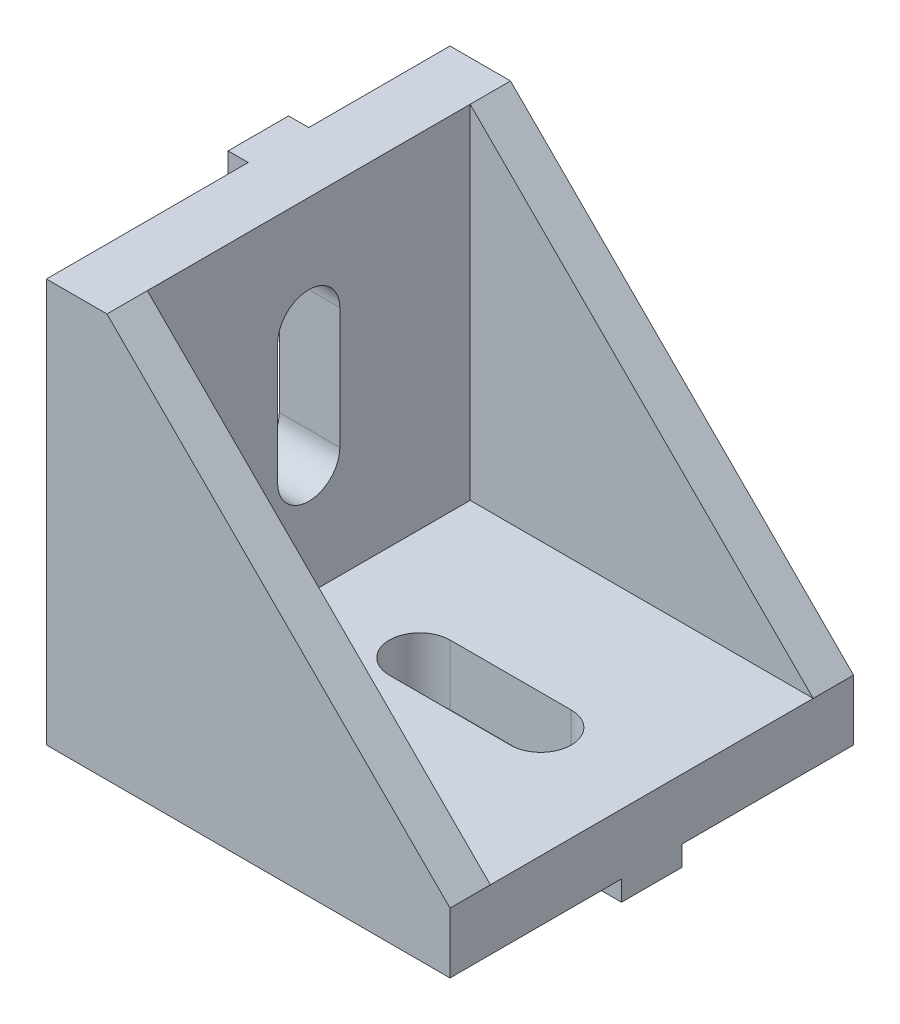
ISO-10303-21;
HEADER;
FILE_DESCRIPTION(('STEP AP214'),'2;1');
FILE_NAME('part.step','',(''),(''),'','','');
FILE_SCHEMA(('AUTOMOTIVE_DESIGN { 1 0 10303 214 1 1 1 1 }'));
ENDSEC;
DATA;
#1=APPLICATION_CONTEXT('core data for automotive mechanical design processes');
#2=APPLICATION_PROTOCOL_DEFINITION('international standard','automotive_design',2000,#1);
#3=PRODUCT_CONTEXT('',#1,'mechanical');
#4=PRODUCT('Part','Part','',(#3));
#5=PRODUCT_RELATED_PRODUCT_CATEGORY('part','',(#4));
#6=PRODUCT_DEFINITION_FORMATION('','',#4);
#7=PRODUCT_DEFINITION_CONTEXT('part definition',#1,'design');
#8=PRODUCT_DEFINITION('design','',#6,#7);
#9=PRODUCT_DEFINITION_SHAPE('','',#8);
#10=(LENGTH_UNIT() NAMED_UNIT(*) SI_UNIT(.MILLI.,.METRE.));
#11=(NAMED_UNIT(*) PLANE_ANGLE_UNIT() SI_UNIT($,.RADIAN.));
#12=(NAMED_UNIT(*) SI_UNIT($,.STERADIAN.) SOLID_ANGLE_UNIT());
#13=UNCERTAINTY_MEASURE_WITH_UNIT(LENGTH_MEASURE(1.E-05),#10,'distance_accuracy_value','');
#14=(GEOMETRIC_REPRESENTATION_CONTEXT(3) GLOBAL_UNCERTAINTY_ASSIGNED_CONTEXT((#13)) GLOBAL_UNIT_ASSIGNED_CONTEXT((#10,
#11,#12)) REPRESENTATION_CONTEXT('',''));
#15=CARTESIAN_POINT('',(0.,0.,0.));
#16=DIRECTION('',(0.,0.,1.));
#17=DIRECTION('',(1.,0.,0.));
#18=AXIS2_PLACEMENT_3D('',#15,#16,#17);
#19=CARTESIAN_POINT('',(0.,0.,20.));
#20=DIRECTION('',(1.,0.,0.));
#21=DIRECTION('',(0.,0.,-1.));
#22=AXIS2_PLACEMENT_3D('',#19,#20,#21);
#23=PLANE('',#22);
#24=CARTESIAN_POINT('',(0.,8.5,10.));
#25=DIRECTION('',(1.,0.,0.));
#26=DIRECTION('',(0.,1.,0.));
#27=AXIS2_PLACEMENT_3D('',#24,#25,#26);
#28=CIRCLE('',#27,1.54072000044774);
#29=CARTESIAN_POINT('',(0.,8.5,11.5407200004477));
#30=VERTEX_POINT('',#29);
#31=CARTESIAN_POINT('',(0.,8.5,8.45927999955226));
#32=VERTEX_POINT('',#31);
#33=EDGE_CURVE('E451',#30,#32,#28,.T.);
#34=ORIENTED_EDGE('',*,*,#33,.T.);
#35=DIRECTION('',(0.,1.,0.));
#36=VECTOR('',#35,1.);
#37=CARTESIAN_POINT('',(0.,0.,8.45927999955226));
#38=LINE('',#37,#36);
#39=CARTESIAN_POINT('',(0.,14.5,8.45927999955226));
#40=VERTEX_POINT('',#39);
#41=EDGE_CURVE('E438',#32,#40,#38,.T.);
#42=ORIENTED_EDGE('',*,*,#41,.T.);
#43=CARTESIAN_POINT('',(0.,14.5,10.));
#44=DIRECTION('',(1.,0.,0.));
#45=DIRECTION('',(0.,1.,0.));
#46=AXIS2_PLACEMENT_3D('',#43,#44,#45);
#47=CIRCLE('',#46,1.54072000044774);
#48=CARTESIAN_POINT('',(0.,14.5,11.5407200004477));
#49=VERTEX_POINT('',#48);
#50=EDGE_CURVE('E442',#40,#49,#47,.T.);
#51=ORIENTED_EDGE('',*,*,#50,.T.);
#52=DIRECTION('',(0.,1.,0.));
#53=VECTOR('',#52,1.);
#54=CARTESIAN_POINT('',(0.,0.,11.5407200004477));
#55=LINE('',#54,#53);
#56=EDGE_CURVE('E447',#30,#49,#55,.T.);
#57=ORIENTED_EDGE('',*,*,#56,.F.);
#58=EDGE_LOOP('',(#34,#42,#51,#57));
#59=FACE_BOUND('',#58,.T.);
#60=DIRECTION('',(0.,-1.,0.));
#61=VECTOR('',#60,1.);
#62=CARTESIAN_POINT('',(0.,0.,8.5));
#63=LINE('',#62,#61);
#64=CARTESIAN_POINT('',(0.,1.5,8.5));
#65=VERTEX_POINT('',#64);
#66=CARTESIAN_POINT('',(0.,0.,8.5));
#67=VERTEX_POINT('',#66);
#68=EDGE_CURVE('E266',#65,#67,#63,.T.);
#69=ORIENTED_EDGE('',*,*,#68,.F.);
#70=DIRECTION('',(0.,0.,-1.));
#71=VECTOR('',#70,1.);
#72=CARTESIAN_POINT('',(0.,1.5,8.5));
#73=LINE('',#72,#71);
#74=CARTESIAN_POINT('',(0.,1.5,10.));
#75=VERTEX_POINT('',#74);
#76=EDGE_CURVE('E59',#75,#65,#73,.T.);
#77=ORIENTED_EDGE('',*,*,#76,.F.);
#78=DIRECTION('',(0.,1.,0.));
#79=VECTOR('',#78,1.);
#80=CARTESIAN_POINT('',(0.,0.,10.));
#81=LINE('',#80,#79);
#82=CARTESIAN_POINT('',(0.,0.,10.));
#83=VERTEX_POINT('',#82);
#84=EDGE_CURVE('E54',#83,#75,#81,.T.);
#85=ORIENTED_EDGE('',*,*,#84,.F.);
#86=DIRECTION('',(0.,0.,1.));
#87=VECTOR('',#86,1.);
#88=CARTESIAN_POINT('',(0.,0.,8.5));
#89=LINE('',#88,#87);
#90=EDGE_CURVE('E956',#67,#83,#89,.T.);
#91=ORIENTED_EDGE('',*,*,#90,.F.);
#92=DIRECTION('',(0.,1.,0.));
#93=VECTOR('',#92,1.);
#94=CARTESIAN_POINT('',(0.,-1.,8.5));
#95=LINE('',#94,#93);
#96=CARTESIAN_POINT('',(0.,-1.,8.5));
#97=VERTEX_POINT('',#96);
#98=EDGE_CURVE('E381',#97,#67,#95,.T.);
#99=ORIENTED_EDGE('',*,*,#98,.F.);
#100=DIRECTION('',(0.,0.,-1.));
#101=VECTOR('',#100,1.);
#102=CARTESIAN_POINT('',(0.,-1.,8.5));
#103=LINE('',#102,#101);
#104=CARTESIAN_POINT('',(0.,-1.,11.5));
#105=VERTEX_POINT('',#104);
#106=EDGE_CURVE('E361',#105,#97,#103,.T.);
#107=ORIENTED_EDGE('',*,*,#106,.F.);
#108=DIRECTION('',(0.,1.,0.));
#109=VECTOR('',#108,1.);
#110=CARTESIAN_POINT('',(0.,-1.,11.5));
#111=LINE('',#110,#109);
#112=CARTESIAN_POINT('',(0.,0.,11.5));
#113=VERTEX_POINT('',#112);
#114=EDGE_CURVE('E385',#105,#113,#111,.T.);
#115=ORIENTED_EDGE('',*,*,#114,.T.);
#116=DIRECTION('',(0.,0.,-1.));
#117=VECTOR('',#116,1.);
#118=CARTESIAN_POINT('',(0.,0.,20.));
#119=LINE('',#118,#117);
#120=CARTESIAN_POINT('',(0.,0.,20.));
#121=VERTEX_POINT('',#120);
#122=EDGE_CURVE('E11',#121,#113,#119,.T.);
#123=ORIENTED_EDGE('',*,*,#122,.F.);
#124=DIRECTION('',(0.,-1.,0.));
#125=VECTOR('',#124,1.);
#126=CARTESIAN_POINT('',(0.,0.,20.));
#127=LINE('',#126,#125);
#128=CARTESIAN_POINT('',(0.,20.,20.));
#129=VERTEX_POINT('',#128);
#130=EDGE_CURVE('E518',#129,#121,#127,.T.);
#131=ORIENTED_EDGE('',*,*,#130,.F.);
#132=DIRECTION('',(0.,0.,-1.));
#133=VECTOR('',#132,1.);
#134=CARTESIAN_POINT('',(0.,20.,20.));
#135=LINE('',#134,#133);
#136=CARTESIAN_POINT('',(0.,20.,10.));
#137=VERTEX_POINT('',#136);
#138=EDGE_CURVE('E548',#129,#137,#135,.T.);
#139=ORIENTED_EDGE('',*,*,#138,.T.);
#140=DIRECTION('',(0.,1.,0.));
#141=VECTOR('',#140,1.);
#142=CARTESIAN_POINT('',(0.,20.,10.));
#143=LINE('',#142,#141);
#144=CARTESIAN_POINT('',(0.,18.5,10.));
#145=VERTEX_POINT('',#144);
#146=EDGE_CURVE('E268',#145,#137,#143,.T.);
#147=ORIENTED_EDGE('',*,*,#146,.F.);
#148=DIRECTION('',(0.,0.,1.));
#149=VECTOR('',#148,1.);
#150=CARTESIAN_POINT('',(0.,18.5,7.00000000000001));
#151=LINE('',#150,#149);
#152=CARTESIAN_POINT('',(0.,18.5,7.00000000000001));
#153=VERTEX_POINT('',#152);
#154=EDGE_CURVE('E284',#153,#145,#151,.T.);
#155=ORIENTED_EDGE('',*,*,#154,.F.);
#156=DIRECTION('',(0.,-1.,0.));
#157=VECTOR('',#156,1.);
#158=CARTESIAN_POINT('',(0.,20.,7.00000000000001));
#159=LINE('',#158,#157);
#160=CARTESIAN_POINT('',(0.,20.,7.00000000000001));
#161=VERTEX_POINT('',#160);
#162=EDGE_CURVE('E273',#161,#153,#159,.T.);
#163=ORIENTED_EDGE('',*,*,#162,.F.);
#164=CARTESIAN_POINT('',(0.,20.,0.));
#165=VERTEX_POINT('',#164);
#166=EDGE_CURVE('E533',#161,#165,#135,.T.);
#167=ORIENTED_EDGE('',*,*,#166,.T.);
#168=DIRECTION('',(0.,-1.,0.));
#169=VECTOR('',#168,1.);
#170=CARTESIAN_POINT('',(0.,0.,0.));
#171=LINE('',#170,#169);
#172=CARTESIAN_POINT('',(0.,0.,0.));
#173=VERTEX_POINT('',#172);
#174=EDGE_CURVE('E517',#165,#173,#171,.T.);
#175=ORIENTED_EDGE('',*,*,#174,.T.);
#176=EDGE_CURVE('E47',#67,#173,#119,.T.);
#177=ORIENTED_EDGE('',*,*,#176,.F.);
#178=EDGE_LOOP('',(#69,#77,#85,#91,#99,#107,#115,#123,#131,#139,#147,#155,#163,#167,#175,#177));
#179=FACE_BOUND('',#178,.T.);
#180=ADVANCED_FACE('F39',(#59,#179),#23,.F.);
#181=CARTESIAN_POINT('',(0.,0.,20.));
#182=DIRECTION('',(0.,1.,0.));
#183=DIRECTION('',(0.,0.,1.));
#184=AXIS2_PLACEMENT_3D('',#181,#182,#183);
#185=PLANE('',#184);
#186=CARTESIAN_POINT('',(8.5,0.,10.));
#187=DIRECTION('',(0.,1.,0.));
#188=DIRECTION('',(0.,0.,1.));
#189=AXIS2_PLACEMENT_3D('',#186,#187,#188);
#190=CIRCLE('',#189,1.50789450694177);
#191=CARTESIAN_POINT('',(8.5,0.,8.49210549305823));
#192=VERTEX_POINT('',#191);
#193=CARTESIAN_POINT('',(8.5,0.,11.5078945069418));
#194=VERTEX_POINT('',#193);
#195=EDGE_CURVE('E407',#192,#194,#190,.T.);
#196=ORIENTED_EDGE('',*,*,#195,.T.);
#197=DIRECTION('',(1.,0.,0.));
#198=VECTOR('',#197,1.);
#199=CARTESIAN_POINT('',(0.,0.,11.5078945069418));
#200=LINE('',#199,#198);
#201=CARTESIAN_POINT('',(14.5,0.,11.5078945069418));
#202=VERTEX_POINT('',#201);
#203=EDGE_CURVE('E394',#194,#202,#200,.T.);
#204=ORIENTED_EDGE('',*,*,#203,.T.);
#205=CARTESIAN_POINT('',(14.5,0.,10.));
#206=DIRECTION('',(0.,1.,0.));
#207=DIRECTION('',(0.,0.,1.));
#208=AXIS2_PLACEMENT_3D('',#205,#206,#207);
#209=CIRCLE('',#208,1.50789450694177);
#210=CARTESIAN_POINT('',(14.5,0.,8.49210549305823));
#211=VERTEX_POINT('',#210);
#212=EDGE_CURVE('E398',#202,#211,#209,.T.);
#213=ORIENTED_EDGE('',*,*,#212,.T.);
#214=DIRECTION('',(1.,0.,0.));
#215=VECTOR('',#214,1.);
#216=CARTESIAN_POINT('',(0.,0.,8.49210549305823));
#217=LINE('',#216,#215);
#218=EDGE_CURVE('E403',#192,#211,#217,.T.);
#219=ORIENTED_EDGE('',*,*,#218,.F.);
#220=EDGE_LOOP('',(#196,#204,#213,#219));
#221=FACE_BOUND('',#220,.T.);
#222=DIRECTION('',(-1.,0.,0.));
#223=VECTOR('',#222,1.);
#224=CARTESIAN_POINT('',(18.5,0.,11.5));
#225=LINE('',#224,#223);
#226=CARTESIAN_POINT('',(20.,0.,11.5));
#227=VERTEX_POINT('',#226);
#228=CARTESIAN_POINT('',(18.5,0.,11.5));
#229=VERTEX_POINT('',#228);
#230=EDGE_CURVE('E315',#227,#229,#225,.T.);
#231=ORIENTED_EDGE('',*,*,#230,.F.);
#232=DIRECTION('',(0.,0.,-1.));
#233=VECTOR('',#232,1.);
#234=CARTESIAN_POINT('',(20.,0.,20.));
#235=LINE('',#234,#233);
#236=CARTESIAN_POINT('',(20.,0.,20.));
#237=VERTEX_POINT('',#236);
#238=EDGE_CURVE('E564',#237,#227,#235,.T.);
#239=ORIENTED_EDGE('',*,*,#238,.F.);
#240=DIRECTION('',(1.,0.,0.));
#241=VECTOR('',#240,1.);
#242=CARTESIAN_POINT('',(0.,0.,20.));
#243=LINE('',#242,#241);
#244=EDGE_CURVE('E522',#121,#237,#243,.T.);
#245=ORIENTED_EDGE('',*,*,#244,.F.);
#246=ORIENTED_EDGE('',*,*,#122,.T.);
#247=DIRECTION('',(-1.,0.,0.));
#248=VECTOR('',#247,1.);
#249=CARTESIAN_POINT('',(0.,0.,11.5));
#250=LINE('',#249,#248);
#251=CARTESIAN_POINT('',(1.5,0.,11.5));
#252=VERTEX_POINT('',#251);
#253=EDGE_CURVE('E371',#252,#113,#250,.T.);
#254=ORIENTED_EDGE('',*,*,#253,.F.);
#255=DIRECTION('',(0.,0.,1.));
#256=VECTOR('',#255,1.);
#257=CARTESIAN_POINT('',(1.5,0.,8.5));
#258=LINE('',#257,#256);
#259=CARTESIAN_POINT('',(1.5,0.,8.5));
#260=VERTEX_POINT('',#259);
#261=EDGE_CURVE('E352',#260,#252,#258,.T.);
#262=ORIENTED_EDGE('',*,*,#261,.F.);
#263=DIRECTION('',(1.,0.,0.));
#264=VECTOR('',#263,1.);
#265=CARTESIAN_POINT('',(0.,0.,8.5));
#266=LINE('',#265,#264);
#267=EDGE_CURVE('E358',#67,#260,#266,.T.);
#268=ORIENTED_EDGE('',*,*,#267,.F.);
#269=ORIENTED_EDGE('',*,*,#176,.T.);
#270=DIRECTION('',(1.,0.,0.));
#271=VECTOR('',#270,1.);
#272=CARTESIAN_POINT('',(0.,0.,0.));
#273=LINE('',#272,#271);
#274=CARTESIAN_POINT('',(20.,0.,0.));
#275=VERTEX_POINT('',#274);
#276=EDGE_CURVE('E537',#173,#275,#273,.T.);
#277=ORIENTED_EDGE('',*,*,#276,.T.);
#278=CARTESIAN_POINT('',(20.,0.,8.5));
#279=VERTEX_POINT('',#278);
#280=EDGE_CURVE('E563',#279,#275,#235,.T.);
#281=ORIENTED_EDGE('',*,*,#280,.F.);
#282=DIRECTION('',(1.,0.,0.));
#283=VECTOR('',#282,1.);
#284=CARTESIAN_POINT('',(18.5,0.,8.5));
#285=LINE('',#284,#283);
#286=CARTESIAN_POINT('',(18.5,0.,8.5));
#287=VERTEX_POINT('',#286);
#288=EDGE_CURVE('E321',#287,#279,#285,.T.);
#289=ORIENTED_EDGE('',*,*,#288,.F.);
#290=DIRECTION('',(0.,0.,-1.));
#291=VECTOR('',#290,1.);
#292=CARTESIAN_POINT('',(18.5,0.,8.5));
#293=LINE('',#292,#291);
#294=EDGE_CURVE('E333',#229,#287,#293,.T.);
#295=ORIENTED_EDGE('',*,*,#294,.F.);
#296=EDGE_LOOP('',(#231,#239,#245,#246,#254,#262,#268,#269,#277,#281,#289,#295));
#297=FACE_BOUND('',#296,.T.);
#298=ADVANCED_FACE('F583',(#221,#297),#185,.F.);
#299=CARTESIAN_POINT('',(3.,3.,20.));
#300=DIRECTION('',(0.,-1.,0.));
#301=DIRECTION('',(0.,0.,-1.));
#302=AXIS2_PLACEMENT_3D('',#299,#300,#301);
#303=PLANE('',#302);
#304=CARTESIAN_POINT('',(14.5,3.,10.));
#305=DIRECTION('',(0.,1.,0.));
#306=DIRECTION('',(0.,0.,1.));
#307=AXIS2_PLACEMENT_3D('',#304,#305,#306);
#308=CIRCLE('',#307,1.50789450694177);
#309=CARTESIAN_POINT('',(14.5,3.,11.5078945069418));
#310=VERTEX_POINT('',#309);
#311=CARTESIAN_POINT('',(14.5,3.,8.49210549305823));
#312=VERTEX_POINT('',#311);
#313=EDGE_CURVE('E414',#310,#312,#308,.T.);
#314=ORIENTED_EDGE('',*,*,#313,.F.);
#315=DIRECTION('',(1.,0.,0.));
#316=VECTOR('',#315,1.);
#317=CARTESIAN_POINT('',(0.,3.,11.5078945069418));
#318=LINE('',#317,#316);
#319=CARTESIAN_POINT('',(8.5,3.,11.5078945069418));
#320=VERTEX_POINT('',#319);
#321=EDGE_CURVE('E393',#320,#310,#318,.T.);
#322=ORIENTED_EDGE('',*,*,#321,.F.);
#323=CARTESIAN_POINT('',(8.5,3.,10.));
#324=DIRECTION('',(0.,1.,0.));
#325=DIRECTION('',(0.,0.,1.));
#326=AXIS2_PLACEMENT_3D('',#323,#324,#325);
#327=CIRCLE('',#326,1.50789450694177);
#328=CARTESIAN_POINT('',(8.5,3.,8.49210549305823));
#329=VERTEX_POINT('',#328);
#330=EDGE_CURVE('E399',#329,#320,#327,.T.);
#331=ORIENTED_EDGE('',*,*,#330,.F.);
#332=DIRECTION('',(1.,0.,0.));
#333=VECTOR('',#332,1.);
#334=CARTESIAN_POINT('',(0.,3.,8.49210549305823));
#335=LINE('',#334,#333);
#336=EDGE_CURVE('E418',#329,#312,#335,.T.);
#337=ORIENTED_EDGE('',*,*,#336,.T.);
#338=EDGE_LOOP('',(#314,#322,#331,#337));
#339=FACE_BOUND('',#338,.T.);
#340=DIRECTION('',(1.,0.,0.));
#341=VECTOR('',#340,1.);
#342=CARTESIAN_POINT('',(3.,3.,2.));
#343=LINE('',#342,#341);
#344=CARTESIAN_POINT('',(3.,3.,2.));
#345=VERTEX_POINT('',#344);
#346=CARTESIAN_POINT('',(20.,3.,2.));
#347=VERTEX_POINT('',#346);
#348=EDGE_CURVE('E499',#345,#347,#343,.T.);
#349=ORIENTED_EDGE('',*,*,#348,.F.);
#350=DIRECTION('',(0.,0.,-1.));
#351=VECTOR('',#350,1.);
#352=CARTESIAN_POINT('',(3.,3.,20.));
#353=LINE('',#352,#351);
#354=CARTESIAN_POINT('',(3.,3.,18.));
#355=VERTEX_POINT('',#354);
#356=EDGE_CURVE('E556',#355,#345,#353,.T.);
#357=ORIENTED_EDGE('',*,*,#356,.F.);
#358=DIRECTION('',(1.,0.,0.));
#359=VECTOR('',#358,1.);
#360=CARTESIAN_POINT('',(3.,3.,18.));
#361=LINE('',#360,#359);
#362=CARTESIAN_POINT('',(20.,3.,18.));
#363=VERTEX_POINT('',#362);
#364=EDGE_CURVE('E513',#355,#363,#361,.T.);
#365=ORIENTED_EDGE('',*,*,#364,.T.);
#366=DIRECTION('',(0.,0.,-1.));
#367=VECTOR('',#366,1.);
#368=CARTESIAN_POINT('',(20.,3.,20.));
#369=LINE('',#368,#367);
#370=EDGE_CURVE('E560',#363,#347,#369,.T.);
#371=ORIENTED_EDGE('',*,*,#370,.T.);
#372=EDGE_LOOP('',(#349,#357,#365,#371));
#373=FACE_BOUND('',#372,.T.);
#374=ADVANCED_FACE('F633',(#339,#373),#303,.F.);
#375=CARTESIAN_POINT('',(3.,20.,20.));
#376=DIRECTION('',(-1.,0.,0.));
#377=DIRECTION('',(0.,-1.,0.));
#378=AXIS2_PLACEMENT_3D('',#375,#376,#377);
#379=PLANE('',#378);
#380=CARTESIAN_POINT('',(3.,14.5,10.));
#381=DIRECTION('',(1.,0.,0.));
#382=DIRECTION('',(0.,1.,0.));
#383=AXIS2_PLACEMENT_3D('',#380,#381,#382);
#384=CIRCLE('',#383,1.54072000044774);
#385=CARTESIAN_POINT('',(3.,14.5,8.45927999955226));
#386=VERTEX_POINT('',#385);
#387=CARTESIAN_POINT('',(3.,14.5,11.5407200004477));
#388=VERTEX_POINT('',#387);
#389=EDGE_CURVE('E458',#386,#388,#384,.T.);
#390=ORIENTED_EDGE('',*,*,#389,.F.);
#391=DIRECTION('',(0.,1.,0.));
#392=VECTOR('',#391,1.);
#393=CARTESIAN_POINT('',(3.,0.,8.45927999955226));
#394=LINE('',#393,#392);
#395=CARTESIAN_POINT('',(3.,8.5,8.45927999955226));
#396=VERTEX_POINT('',#395);
#397=EDGE_CURVE('E428',#396,#386,#394,.T.);
#398=ORIENTED_EDGE('',*,*,#397,.F.);
#399=CARTESIAN_POINT('',(3.,8.5,10.));
#400=DIRECTION('',(1.,0.,0.));
#401=DIRECTION('',(0.,1.,0.));
#402=AXIS2_PLACEMENT_3D('',#399,#400,#401);
#403=CIRCLE('',#402,1.54072000044774);
#404=CARTESIAN_POINT('',(3.,8.5,11.5407200004477));
#405=VERTEX_POINT('',#404);
#406=EDGE_CURVE('E443',#405,#396,#403,.T.);
#407=ORIENTED_EDGE('',*,*,#406,.F.);
#408=DIRECTION('',(0.,1.,0.));
#409=VECTOR('',#408,1.);
#410=CARTESIAN_POINT('',(3.,0.,11.5407200004477));
#411=LINE('',#410,#409);
#412=EDGE_CURVE('E462',#405,#388,#411,.T.);
#413=ORIENTED_EDGE('',*,*,#412,.T.);
#414=EDGE_LOOP('',(#390,#398,#407,#413));
#415=FACE_BOUND('',#414,.T.);
#416=DIRECTION('',(0.,-1.,0.));
#417=VECTOR('',#416,1.);
#418=CARTESIAN_POINT('',(3.,20.,2.));
#419=LINE('',#418,#417);
#420=CARTESIAN_POINT('',(3.,20.,2.));
#421=VERTEX_POINT('',#420);
#422=EDGE_CURVE('E493',#421,#345,#419,.T.);
#423=ORIENTED_EDGE('',*,*,#422,.F.);
#424=DIRECTION('',(0.,0.,-1.));
#425=VECTOR('',#424,1.);
#426=CARTESIAN_POINT('',(3.,20.,20.));
#427=LINE('',#426,#425);
#428=CARTESIAN_POINT('',(3.,20.,18.));
#429=VERTEX_POINT('',#428);
#430=EDGE_CURVE('E551',#429,#421,#427,.T.);
#431=ORIENTED_EDGE('',*,*,#430,.F.);
#432=DIRECTION('',(0.,-1.,0.));
#433=VECTOR('',#432,1.);
#434=CARTESIAN_POINT('',(3.,20.,18.));
#435=LINE('',#434,#433);
#436=EDGE_CURVE('E506',#429,#355,#435,.T.);
#437=ORIENTED_EDGE('',*,*,#436,.T.);
#438=ORIENTED_EDGE('',*,*,#356,.T.);
#439=EDGE_LOOP('',(#423,#431,#437,#438));
#440=FACE_BOUND('',#439,.T.);
#441=ADVANCED_FACE('F652',(#415,#440),#379,.F.);
#442=CARTESIAN_POINT('',(20.,3.,20.));
#443=DIRECTION('',(-1.,0.,0.));
#444=DIRECTION('',(0.,0.,1.));
#445=AXIS2_PLACEMENT_3D('',#442,#443,#444);
#446=PLANE('',#445);
#447=DIRECTION('',(0.,0.,-1.));
#448=VECTOR('',#447,1.);
#449=CARTESIAN_POINT('',(20.,3.,2.));
#450=LINE('',#449,#448);
#451=CARTESIAN_POINT('',(20.,3.,0.));
#452=VERTEX_POINT('',#451);
#453=EDGE_CURVE('E490',#347,#452,#450,.T.);
#454=ORIENTED_EDGE('',*,*,#453,.F.);
#455=ORIENTED_EDGE('',*,*,#370,.F.);
#456=CARTESIAN_POINT('',(20.,3.,20.));
#457=VERTEX_POINT('',#456);
#458=EDGE_CURVE('E561',#457,#363,#369,.T.);
#459=ORIENTED_EDGE('',*,*,#458,.F.);
#460=DIRECTION('',(0.,1.,0.));
#461=VECTOR('',#460,1.);
#462=CARTESIAN_POINT('',(20.,3.,20.));
#463=LINE('',#462,#461);
#464=EDGE_CURVE('E526',#237,#457,#463,.T.);
#465=ORIENTED_EDGE('',*,*,#464,.F.);
#466=ORIENTED_EDGE('',*,*,#238,.T.);
#467=DIRECTION('',(0.,1.,0.));
#468=VECTOR('',#467,1.);
#469=CARTESIAN_POINT('',(20.,-1.,11.5));
#470=LINE('',#469,#468);
#471=CARTESIAN_POINT('',(20.,-1.,11.5));
#472=VERTEX_POINT('',#471);
#473=EDGE_CURVE('E349',#472,#227,#470,.T.);
#474=ORIENTED_EDGE('',*,*,#473,.F.);
#475=DIRECTION('',(0.,0.,1.));
#476=VECTOR('',#475,1.);
#477=CARTESIAN_POINT('',(20.,-1.,8.5));
#478=LINE('',#477,#476);
#479=CARTESIAN_POINT('',(20.,-1.,8.5));
#480=VERTEX_POINT('',#479);
#481=EDGE_CURVE('E316',#480,#472,#478,.T.);
#482=ORIENTED_EDGE('',*,*,#481,.F.);
#483=DIRECTION('',(0.,1.,0.));
#484=VECTOR('',#483,1.);
#485=CARTESIAN_POINT('',(20.,-1.,8.5));
#486=LINE('',#485,#484);
#487=EDGE_CURVE('E330',#480,#279,#486,.T.);
#488=ORIENTED_EDGE('',*,*,#487,.T.);
#489=ORIENTED_EDGE('',*,*,#280,.T.);
#490=DIRECTION('',(0.,1.,0.));
#491=VECTOR('',#490,1.);
#492=CARTESIAN_POINT('',(20.,3.,0.));
#493=LINE('',#492,#491);
#494=EDGE_CURVE('E541',#275,#452,#493,.T.);
#495=ORIENTED_EDGE('',*,*,#494,.T.);
#496=EDGE_LOOP('',(#454,#455,#459,#465,#466,#474,#482,#488,#489,#495));
#497=FACE_BOUND('',#496,.T.);
#498=ADVANCED_FACE('F575',(#497),#446,.F.);
#499=CARTESIAN_POINT('',(0.,20.,20.));
#500=DIRECTION('',(0.,-1.,0.));
#501=DIRECTION('',(0.,0.,-1.));
#502=AXIS2_PLACEMENT_3D('',#499,#500,#501);
#503=PLANE('',#502);
#504=DIRECTION('',(-1.,0.,0.));
#505=VECTOR('',#504,1.);
#506=CARTESIAN_POINT('',(0.,20.,0.));
#507=LINE('',#506,#505);
#508=CARTESIAN_POINT('',(3.,20.,0.));
#509=VERTEX_POINT('',#508);
#510=EDGE_CURVE('E523',#509,#165,#507,.T.);
#511=ORIENTED_EDGE('',*,*,#510,.T.);
#512=ORIENTED_EDGE('',*,*,#166,.F.);
#513=DIRECTION('',(1.,0.,0.));
#514=VECTOR('',#513,1.);
#515=CARTESIAN_POINT('',(-1.,20.,7.00000000000001));
#516=LINE('',#515,#514);
#517=CARTESIAN_POINT('',(-1.,20.,7.00000000000001));
#518=VERTEX_POINT('',#517);
#519=EDGE_CURVE('E307',#518,#161,#516,.T.);
#520=ORIENTED_EDGE('',*,*,#519,.F.);
#521=DIRECTION('',(0.,0.,-1.));
#522=VECTOR('',#521,1.);
#523=CARTESIAN_POINT('',(-1.,20.,7.00000000000001));
#524=LINE('',#523,#522);
#525=CARTESIAN_POINT('',(-1.,20.,10.));
#526=VERTEX_POINT('',#525);
#527=EDGE_CURVE('E283',#526,#518,#524,.T.);
#528=ORIENTED_EDGE('',*,*,#527,.F.);
#529=DIRECTION('',(1.,0.,0.));
#530=VECTOR('',#529,1.);
#531=CARTESIAN_POINT('',(-1.,20.,10.));
#532=LINE('',#531,#530);
#533=EDGE_CURVE('E311',#526,#137,#532,.T.);
#534=ORIENTED_EDGE('',*,*,#533,.T.);
#535=ORIENTED_EDGE('',*,*,#138,.F.);
#536=DIRECTION('',(-1.,0.,0.));
#537=VECTOR('',#536,1.);
#538=CARTESIAN_POINT('',(0.,20.,20.));
#539=LINE('',#538,#537);
#540=CARTESIAN_POINT('',(3.,20.,20.));
#541=VERTEX_POINT('',#540);
#542=EDGE_CURVE('E530',#541,#129,#539,.T.);
#543=ORIENTED_EDGE('',*,*,#542,.F.);
#544=EDGE_CURVE('E552',#541,#429,#427,.T.);
#545=ORIENTED_EDGE('',*,*,#544,.T.);
#546=ORIENTED_EDGE('',*,*,#430,.T.);
#547=DIRECTION('',(0.,0.,-1.));
#548=VECTOR('',#547,1.);
#549=CARTESIAN_POINT('',(3.,20.,2.));
#550=LINE('',#549,#548);
#551=EDGE_CURVE('E486',#421,#509,#550,.T.);
#552=ORIENTED_EDGE('',*,*,#551,.T.);
#553=EDGE_LOOP('',(#511,#512,#520,#528,#534,#535,#543,#545,#546,#552));
#554=FACE_BOUND('',#553,.T.);
#555=ADVANCED_FACE('F595',(#554),#503,.F.);
#556=CARTESIAN_POINT('',(0.,0.,20.));
#557=DIRECTION('',(0.,0.,-1.));
#558=DIRECTION('',(-1.,0.,0.));
#559=AXIS2_PLACEMENT_3D('',#556,#557,#558);
#560=PLANE('',#559);
#561=ORIENTED_EDGE('',*,*,#130,.T.);
#562=ORIENTED_EDGE('',*,*,#244,.T.);
#563=ORIENTED_EDGE('',*,*,#464,.T.);
#564=DIRECTION('',(-0.707106781186547,0.707106781186547,0.));
#565=VECTOR('',#564,1.);
#566=CARTESIAN_POINT('',(3.,20.,20.));
#567=LINE('',#566,#565);
#568=EDGE_CURVE('E502',#457,#541,#567,.T.);
#569=ORIENTED_EDGE('',*,*,#568,.T.);
#570=ORIENTED_EDGE('',*,*,#542,.T.);
#571=EDGE_LOOP('',(#561,#562,#563,#569,#570));
#572=FACE_BOUND('',#571,.T.);
#573=ADVANCED_FACE('F677',(#572),#560,.F.);
#574=CARTESIAN_POINT('',(0.,0.,0.));
#575=DIRECTION('',(0.,0.,-1.));
#576=DIRECTION('',(-1.,0.,0.));
#577=AXIS2_PLACEMENT_3D('',#574,#575,#576);
#578=PLANE('',#577);
#579=ORIENTED_EDGE('',*,*,#174,.F.);
#580=ORIENTED_EDGE('',*,*,#510,.F.);
#581=DIRECTION('',(0.707106781186547,-0.707106781186547,0.));
#582=VECTOR('',#581,1.);
#583=CARTESIAN_POINT('',(3.,20.,0.));
#584=LINE('',#583,#582);
#585=EDGE_CURVE('E472',#509,#452,#584,.T.);
#586=ORIENTED_EDGE('',*,*,#585,.T.);
#587=ORIENTED_EDGE('',*,*,#494,.F.);
#588=ORIENTED_EDGE('',*,*,#276,.F.);
#589=EDGE_LOOP('',(#579,#580,#586,#587,#588));
#590=FACE_BOUND('',#589,.T.);
#591=ADVANCED_FACE('F588',(#590),#578,.T.);
#592=CARTESIAN_POINT('',(0.,0.,18.));
#593=DIRECTION('',(0.,0.,-1.));
#594=DIRECTION('',(-1.,0.,0.));
#595=AXIS2_PLACEMENT_3D('',#592,#593,#594);
#596=PLANE('',#595);
#597=ORIENTED_EDGE('',*,*,#364,.F.);
#598=ORIENTED_EDGE('',*,*,#436,.F.);
#599=DIRECTION('',(-0.707106781186547,0.707106781186547,0.));
#600=VECTOR('',#599,1.);
#601=CARTESIAN_POINT('',(3.,20.,18.));
#602=LINE('',#601,#600);
#603=EDGE_CURVE('E503',#363,#429,#602,.T.);
#604=ORIENTED_EDGE('',*,*,#603,.F.);
#605=EDGE_LOOP('',(#597,#598,#604));
#606=FACE_BOUND('',#605,.T.);
#607=ADVANCED_FACE('F669',(#606),#596,.T.);
#608=CARTESIAN_POINT('',(3.,20.,18.));
#609=DIRECTION('',(0.707106781186547,0.707106781186547,0.));
#610=DIRECTION('',(-0.707106781186548,0.707106781186548,0.));
#611=AXIS2_PLACEMENT_3D('',#608,#609,#610);
#612=PLANE('',#611);
#613=ORIENTED_EDGE('',*,*,#568,.F.);
#614=ORIENTED_EDGE('',*,*,#458,.T.);
#615=ORIENTED_EDGE('',*,*,#603,.T.);
#616=ORIENTED_EDGE('',*,*,#544,.F.);
#617=EDGE_LOOP('',(#613,#614,#615,#616));
#618=FACE_BOUND('',#617,.T.);
#619=ADVANCED_FACE('F666',(#618),#612,.T.);
#620=CARTESIAN_POINT('',(0.,0.,2.));
#621=DIRECTION('',(0.,0.,-1.));
#622=DIRECTION('',(-1.,0.,0.));
#623=AXIS2_PLACEMENT_3D('',#620,#621,#622);
#624=PLANE('',#623);
#625=ORIENTED_EDGE('',*,*,#422,.T.);
#626=ORIENTED_EDGE('',*,*,#348,.T.);
#627=DIRECTION('',(0.707106781186547,-0.707106781186547,0.));
#628=VECTOR('',#627,1.);
#629=CARTESIAN_POINT('',(3.,20.,2.));
#630=LINE('',#629,#628);
#631=EDGE_CURVE('E482',#421,#347,#630,.T.);
#632=ORIENTED_EDGE('',*,*,#631,.F.);
#633=EDGE_LOOP('',(#625,#626,#632));
#634=FACE_BOUND('',#633,.T.);
#635=ADVANCED_FACE('F658',(#634),#624,.F.);
#636=CARTESIAN_POINT('',(3.,20.,2.));
#637=DIRECTION('',(0.707106781186547,0.707106781186547,0.));
#638=DIRECTION('',(-0.707106781186548,0.707106781186548,0.));
#639=AXIS2_PLACEMENT_3D('',#636,#637,#638);
#640=PLANE('',#639);
#641=ORIENTED_EDGE('',*,*,#585,.F.);
#642=ORIENTED_EDGE('',*,*,#551,.F.);
#643=ORIENTED_EDGE('',*,*,#631,.T.);
#644=ORIENTED_EDGE('',*,*,#453,.T.);
#645=EDGE_LOOP('',(#641,#642,#643,#644));
#646=FACE_BOUND('',#645,.T.);
#647=ADVANCED_FACE('F591',(#646),#640,.T.);
#648=CARTESIAN_POINT('',(0.,0.,8.45927999955226));
#649=DIRECTION('',(0.,0.,-1.));
#650=DIRECTION('',(-1.,0.,0.));
#651=AXIS2_PLACEMENT_3D('',#648,#649,#650);
#652=PLANE('',#651);
#653=ORIENTED_EDGE('',*,*,#397,.T.);
#654=DIRECTION('',(1.,0.,0.));
#655=VECTOR('',#654,1.);
#656=CARTESIAN_POINT('',(0.,14.5,8.45927999955226));
#657=LINE('',#656,#655);
#658=EDGE_CURVE('E455',#40,#386,#657,.T.);
#659=ORIENTED_EDGE('',*,*,#658,.F.);
#660=ORIENTED_EDGE('',*,*,#41,.F.);
#661=DIRECTION('',(1.,0.,0.));
#662=VECTOR('',#661,1.);
#663=CARTESIAN_POINT('',(0.,8.5,8.45927999955226));
#664=LINE('',#663,#662);
#665=EDGE_CURVE('E469',#32,#396,#664,.T.);
#666=ORIENTED_EDGE('',*,*,#665,.T.);
#667=EDGE_LOOP('',(#653,#659,#660,#666));
#668=FACE_BOUND('',#667,.T.);
#669=ADVANCED_FACE('F644',(#668),#652,.F.);
#670=CARTESIAN_POINT('',(0.,8.5,10.));
#671=DIRECTION('',(1.,0.,0.));
#672=DIRECTION('',(0.,1.,0.));
#673=AXIS2_PLACEMENT_3D('',#670,#671,#672);
#674=CYLINDRICAL_SURFACE('',#673,1.54072000044774);
#675=ORIENTED_EDGE('',*,*,#406,.T.);
#676=ORIENTED_EDGE('',*,*,#665,.F.);
#677=ORIENTED_EDGE('',*,*,#33,.F.);
#678=DIRECTION('',(1.,0.,0.));
#679=VECTOR('',#678,1.);
#680=CARTESIAN_POINT('',(0.,8.5,11.5407200004477));
#681=LINE('',#680,#679);
#682=EDGE_CURVE('E473',#30,#405,#681,.T.);
#683=ORIENTED_EDGE('',*,*,#682,.T.);
#684=EDGE_LOOP('',(#675,#676,#677,#683));
#685=FACE_BOUND('',#684,.T.);
#686=ADVANCED_FACE('F639',(#685),#674,.F.);
#687=CARTESIAN_POINT('',(0.,0.,11.5407200004477));
#688=DIRECTION('',(0.,0.,-1.));
#689=DIRECTION('',(-1.,0.,0.));
#690=AXIS2_PLACEMENT_3D('',#687,#688,#689);
#691=PLANE('',#690);
#692=ORIENTED_EDGE('',*,*,#412,.F.);
#693=ORIENTED_EDGE('',*,*,#682,.F.);
#694=ORIENTED_EDGE('',*,*,#56,.T.);
#695=DIRECTION('',(1.,0.,0.));
#696=VECTOR('',#695,1.);
#697=CARTESIAN_POINT('',(0.,14.5,11.5407200004477));
#698=LINE('',#697,#696);
#699=EDGE_CURVE('E476',#49,#388,#698,.T.);
#700=ORIENTED_EDGE('',*,*,#699,.T.);
#701=EDGE_LOOP('',(#692,#693,#694,#700));
#702=FACE_BOUND('',#701,.T.);
#703=ADVANCED_FACE('F650',(#702),#691,.T.);
#704=CARTESIAN_POINT('',(0.,14.5,10.));
#705=DIRECTION('',(1.,0.,0.));
#706=DIRECTION('',(0.,1.,0.));
#707=AXIS2_PLACEMENT_3D('',#704,#705,#706);
#708=CYLINDRICAL_SURFACE('',#707,1.54072000044774);
#709=ORIENTED_EDGE('',*,*,#389,.T.);
#710=ORIENTED_EDGE('',*,*,#699,.F.);
#711=ORIENTED_EDGE('',*,*,#50,.F.);
#712=ORIENTED_EDGE('',*,*,#658,.T.);
#713=EDGE_LOOP('',(#709,#710,#711,#712));
#714=FACE_BOUND('',#713,.T.);
#715=ADVANCED_FACE('F648',(#714),#708,.F.);
#716=CARTESIAN_POINT('',(0.,0.,11.5078945069418));
#717=DIRECTION('',(0.,0.,1.));
#718=DIRECTION('',(1.,0.,0.));
#719=AXIS2_PLACEMENT_3D('',#716,#717,#718);
#720=PLANE('',#719);
#721=ORIENTED_EDGE('',*,*,#321,.T.);
#722=DIRECTION('',(0.,1.,0.));
#723=VECTOR('',#722,1.);
#724=CARTESIAN_POINT('',(14.5,0.,11.5078945069418));
#725=LINE('',#724,#723);
#726=EDGE_CURVE('E411',#202,#310,#725,.T.);
#727=ORIENTED_EDGE('',*,*,#726,.F.);
#728=ORIENTED_EDGE('',*,*,#203,.F.);
#729=DIRECTION('',(0.,1.,0.));
#730=VECTOR('',#729,1.);
#731=CARTESIAN_POINT('',(8.5,0.,11.5078945069418));
#732=LINE('',#731,#730);
#733=EDGE_CURVE('E425',#194,#320,#732,.T.);
#734=ORIENTED_EDGE('',*,*,#733,.T.);
#735=EDGE_LOOP('',(#721,#727,#728,#734));
#736=FACE_BOUND('',#735,.T.);
#737=ADVANCED_FACE('F767',(#736),#720,.F.);
#738=CARTESIAN_POINT('',(8.5,0.,10.));
#739=DIRECTION('',(0.,1.,0.));
#740=DIRECTION('',(0.,0.,1.));
#741=AXIS2_PLACEMENT_3D('',#738,#739,#740);
#742=CYLINDRICAL_SURFACE('',#741,1.50789450694177);
#743=ORIENTED_EDGE('',*,*,#330,.T.);
#744=ORIENTED_EDGE('',*,*,#733,.F.);
#745=ORIENTED_EDGE('',*,*,#195,.F.);
#746=DIRECTION('',(0.,1.,0.));
#747=VECTOR('',#746,1.);
#748=CARTESIAN_POINT('',(8.5,0.,8.49210549305823));
#749=LINE('',#748,#747);
#750=EDGE_CURVE('E429',#192,#329,#749,.T.);
#751=ORIENTED_EDGE('',*,*,#750,.T.);
#752=EDGE_LOOP('',(#743,#744,#745,#751));
#753=FACE_BOUND('',#752,.T.);
#754=ADVANCED_FACE('F781',(#753),#742,.F.);
#755=CARTESIAN_POINT('',(0.,0.,8.49210549305823));
#756=DIRECTION('',(0.,0.,1.));
#757=DIRECTION('',(1.,0.,0.));
#758=AXIS2_PLACEMENT_3D('',#755,#756,#757);
#759=PLANE('',#758);
#760=ORIENTED_EDGE('',*,*,#336,.F.);
#761=ORIENTED_EDGE('',*,*,#750,.F.);
#762=ORIENTED_EDGE('',*,*,#218,.T.);
#763=DIRECTION('',(0.,1.,0.));
#764=VECTOR('',#763,1.);
#765=CARTESIAN_POINT('',(14.5,0.,8.49210549305823));
#766=LINE('',#765,#764);
#767=EDGE_CURVE('E432',#211,#312,#766,.T.);
#768=ORIENTED_EDGE('',*,*,#767,.T.);
#769=EDGE_LOOP('',(#760,#761,#762,#768));
#770=FACE_BOUND('',#769,.T.);
#771=ADVANCED_FACE('F791',(#770),#759,.T.);
#772=CARTESIAN_POINT('',(14.5,0.,10.));
#773=DIRECTION('',(0.,1.,0.));
#774=DIRECTION('',(0.,0.,1.));
#775=AXIS2_PLACEMENT_3D('',#772,#773,#774);
#776=CYLINDRICAL_SURFACE('',#775,1.50789450694177);
#777=ORIENTED_EDGE('',*,*,#313,.T.);
#778=ORIENTED_EDGE('',*,*,#767,.F.);
#779=ORIENTED_EDGE('',*,*,#212,.F.);
#780=ORIENTED_EDGE('',*,*,#726,.T.);
#781=EDGE_LOOP('',(#777,#778,#779,#780));
#782=FACE_BOUND('',#781,.T.);
#783=ADVANCED_FACE('F800',(#782),#776,.F.);
#784=CARTESIAN_POINT('',(1.5,-1.,8.5));
#785=DIRECTION('',(-1.,0.,0.));
#786=DIRECTION('',(0.,0.,1.));
#787=AXIS2_PLACEMENT_3D('',#784,#785,#786);
#788=PLANE('',#787);
#789=ORIENTED_EDGE('',*,*,#261,.T.);
#790=DIRECTION('',(0.,1.,0.));
#791=VECTOR('',#790,1.);
#792=CARTESIAN_POINT('',(1.5,-1.,11.5));
#793=LINE('',#792,#791);
#794=CARTESIAN_POINT('',(1.5,-1.,11.5));
#795=VERTEX_POINT('',#794);
#796=EDGE_CURVE('E389',#795,#252,#793,.T.);
#797=ORIENTED_EDGE('',*,*,#796,.F.);
#798=DIRECTION('',(0.,0.,1.));
#799=VECTOR('',#798,1.);
#800=CARTESIAN_POINT('',(1.5,-1.,8.5));
#801=LINE('',#800,#799);
#802=CARTESIAN_POINT('',(1.5,-1.,8.5));
#803=VERTEX_POINT('',#802);
#804=EDGE_CURVE('E353',#803,#795,#801,.T.);
#805=ORIENTED_EDGE('',*,*,#804,.F.);
#806=DIRECTION('',(0.,1.,0.));
#807=VECTOR('',#806,1.);
#808=CARTESIAN_POINT('',(1.5,-1.,8.5));
#809=LINE('',#808,#807);
#810=EDGE_CURVE('E367',#803,#260,#809,.T.);
#811=ORIENTED_EDGE('',*,*,#810,.T.);
#812=EDGE_LOOP('',(#789,#797,#805,#811));
#813=FACE_BOUND('',#812,.T.);
#814=ADVANCED_FACE('F809',(#813),#788,.F.);
#815=CARTESIAN_POINT('',(0.,-1.,11.5));
#816=DIRECTION('',(0.,0.,-1.));
#817=DIRECTION('',(-1.,0.,0.));
#818=AXIS2_PLACEMENT_3D('',#815,#816,#817);
#819=PLANE('',#818);
#820=ORIENTED_EDGE('',*,*,#253,.T.);
#821=ORIENTED_EDGE('',*,*,#114,.F.);
#822=DIRECTION('',(-1.,0.,0.));
#823=VECTOR('',#822,1.);
#824=CARTESIAN_POINT('',(0.,-1.,11.5));
#825=LINE('',#824,#823);
#826=EDGE_CURVE('E357',#795,#105,#825,.T.);
#827=ORIENTED_EDGE('',*,*,#826,.F.);
#828=ORIENTED_EDGE('',*,*,#796,.T.);
#829=EDGE_LOOP('',(#820,#821,#827,#828));
#830=FACE_BOUND('',#829,.T.);
#831=ADVANCED_FACE('F819',(#830),#819,.F.);
#832=CARTESIAN_POINT('',(0.,-1.,8.5));
#833=DIRECTION('',(0.,0.,1.));
#834=DIRECTION('',(1.,0.,0.));
#835=AXIS2_PLACEMENT_3D('',#832,#833,#834);
#836=PLANE('',#835);
#837=ORIENTED_EDGE('',*,*,#267,.T.);
#838=ORIENTED_EDGE('',*,*,#810,.F.);
#839=DIRECTION('',(1.,0.,0.));
#840=VECTOR('',#839,1.);
#841=CARTESIAN_POINT('',(0.,-1.,8.5));
#842=LINE('',#841,#840);
#843=EDGE_CURVE('E364',#97,#803,#842,.T.);
#844=ORIENTED_EDGE('',*,*,#843,.F.);
#845=ORIENTED_EDGE('',*,*,#98,.T.);
#846=EDGE_LOOP('',(#837,#838,#844,#845));
#847=FACE_BOUND('',#846,.T.);
#848=ADVANCED_FACE('F827',(#847),#836,.F.);
#849=CARTESIAN_POINT('',(0.,-1.,0.));
#850=DIRECTION('',(0.,1.,0.));
#851=DIRECTION('',(0.,0.,1.));
#852=AXIS2_PLACEMENT_3D('',#849,#850,#851);
#853=PLANE('',#852);
#854=ORIENTED_EDGE('',*,*,#804,.T.);
#855=ORIENTED_EDGE('',*,*,#826,.T.);
#856=ORIENTED_EDGE('',*,*,#106,.T.);
#857=ORIENTED_EDGE('',*,*,#843,.T.);
#858=EDGE_LOOP('',(#854,#855,#856,#857));
#859=FACE_BOUND('',#858,.T.);
#860=ADVANCED_FACE('F835',(#859),#853,.F.);
#861=CARTESIAN_POINT('',(18.5,-1.,11.5));
#862=DIRECTION('',(0.,0.,-1.));
#863=DIRECTION('',(-1.,0.,0.));
#864=AXIS2_PLACEMENT_3D('',#861,#862,#863);
#865=PLANE('',#864);
#866=ORIENTED_EDGE('',*,*,#230,.T.);
#867=DIRECTION('',(0.,1.,0.));
#868=VECTOR('',#867,1.);
#869=CARTESIAN_POINT('',(18.5,-1.,11.5));
#870=LINE('',#869,#868);
#871=CARTESIAN_POINT('',(18.5,-1.,11.5));
#872=VERTEX_POINT('',#871);
#873=EDGE_CURVE('E345',#872,#229,#870,.T.);
#874=ORIENTED_EDGE('',*,*,#873,.F.);
#875=DIRECTION('',(-1.,0.,0.));
#876=VECTOR('',#875,1.);
#877=CARTESIAN_POINT('',(18.5,-1.,11.5));
#878=LINE('',#877,#876);
#879=EDGE_CURVE('E320',#472,#872,#878,.T.);
#880=ORIENTED_EDGE('',*,*,#879,.F.);
#881=ORIENTED_EDGE('',*,*,#473,.T.);
#882=EDGE_LOOP('',(#866,#874,#880,#881));
#883=FACE_BOUND('',#882,.T.);
#884=ADVANCED_FACE('F843',(#883),#865,.F.);
#885=CARTESIAN_POINT('',(18.5,-1.,8.5));
#886=DIRECTION('',(1.,0.,0.));
#887=DIRECTION('',(0.,0.,-1.));
#888=AXIS2_PLACEMENT_3D('',#885,#886,#887);
#889=PLANE('',#888);
#890=ORIENTED_EDGE('',*,*,#294,.T.);
#891=DIRECTION('',(0.,1.,0.));
#892=VECTOR('',#891,1.);
#893=CARTESIAN_POINT('',(18.5,-1.,8.5));
#894=LINE('',#893,#892);
#895=CARTESIAN_POINT('',(18.5,-1.,8.5));
#896=VERTEX_POINT('',#895);
#897=EDGE_CURVE('E341',#896,#287,#894,.T.);
#898=ORIENTED_EDGE('',*,*,#897,.F.);
#899=DIRECTION('',(0.,0.,-1.));
#900=VECTOR('',#899,1.);
#901=CARTESIAN_POINT('',(18.5,-1.,8.5));
#902=LINE('',#901,#900);
#903=EDGE_CURVE('E324',#872,#896,#902,.T.);
#904=ORIENTED_EDGE('',*,*,#903,.F.);
#905=ORIENTED_EDGE('',*,*,#873,.T.);
#906=EDGE_LOOP('',(#890,#898,#904,#905));
#907=FACE_BOUND('',#906,.T.);
#908=ADVANCED_FACE('F851',(#907),#889,.F.);
#909=CARTESIAN_POINT('',(18.5,-1.,8.5));
#910=DIRECTION('',(0.,0.,1.));
#911=DIRECTION('',(1.,0.,0.));
#912=AXIS2_PLACEMENT_3D('',#909,#910,#911);
#913=PLANE('',#912);
#914=ORIENTED_EDGE('',*,*,#288,.T.);
#915=ORIENTED_EDGE('',*,*,#487,.F.);
#916=DIRECTION('',(1.,0.,0.));
#917=VECTOR('',#916,1.);
#918=CARTESIAN_POINT('',(18.5,-1.,8.5));
#919=LINE('',#918,#917);
#920=EDGE_CURVE('E327',#896,#480,#919,.T.);
#921=ORIENTED_EDGE('',*,*,#920,.F.);
#922=ORIENTED_EDGE('',*,*,#897,.T.);
#923=EDGE_LOOP('',(#914,#915,#921,#922));
#924=FACE_BOUND('',#923,.T.);
#925=ADVANCED_FACE('F859',(#924),#913,.F.);
#926=CARTESIAN_POINT('',(0.,-1.,0.));
#927=DIRECTION('',(0.,1.,0.));
#928=DIRECTION('',(0.,0.,1.));
#929=AXIS2_PLACEMENT_3D('',#926,#927,#928);
#930=PLANE('',#929);
#931=ORIENTED_EDGE('',*,*,#481,.T.);
#932=ORIENTED_EDGE('',*,*,#879,.T.);
#933=ORIENTED_EDGE('',*,*,#903,.T.);
#934=ORIENTED_EDGE('',*,*,#920,.T.);
#935=EDGE_LOOP('',(#931,#932,#933,#934));
#936=FACE_BOUND('',#935,.T.);
#937=ADVANCED_FACE('F867',(#936),#930,.F.);
#938=CARTESIAN_POINT('',(-1.,20.,10.));
#939=DIRECTION('',(0.,0.,-1.));
#940=DIRECTION('',(-1.,0.,0.));
#941=AXIS2_PLACEMENT_3D('',#938,#939,#940);
#942=PLANE('',#941);
#943=ORIENTED_EDGE('',*,*,#146,.T.);
#944=ORIENTED_EDGE('',*,*,#533,.F.);
#945=DIRECTION('',(0.,1.,0.));
#946=VECTOR('',#945,1.);
#947=CARTESIAN_POINT('',(-1.,20.,10.));
#948=LINE('',#947,#946);
#949=CARTESIAN_POINT('',(-1.,18.5,10.));
#950=VERTEX_POINT('',#949);
#951=EDGE_CURVE('E279',#950,#526,#948,.T.);
#952=ORIENTED_EDGE('',*,*,#951,.F.);
#953=DIRECTION('',(1.,0.,0.));
#954=VECTOR('',#953,1.);
#955=CARTESIAN_POINT('',(-1.,18.5,10.));
#956=LINE('',#955,#954);
#957=EDGE_CURVE('E292',#950,#145,#956,.T.);
#958=ORIENTED_EDGE('',*,*,#957,.T.);
#959=EDGE_LOOP('',(#943,#944,#952,#958));
#960=FACE_BOUND('',#959,.T.);
#961=ADVANCED_FACE('F617',(#960),#942,.F.);
#962=CARTESIAN_POINT('',(-1.,20.,7.00000000000001));
#963=DIRECTION('',(0.,0.,1.));
#964=DIRECTION('',(1.,0.,0.));
#965=AXIS2_PLACEMENT_3D('',#962,#963,#964);
#966=PLANE('',#965);
#967=ORIENTED_EDGE('',*,*,#162,.T.);
#968=DIRECTION('',(1.,0.,0.));
#969=VECTOR('',#968,1.);
#970=CARTESIAN_POINT('',(-1.,18.5,7.00000000000001));
#971=LINE('',#970,#969);
#972=CARTESIAN_POINT('',(-1.,18.5,7.00000000000001));
#973=VERTEX_POINT('',#972);
#974=EDGE_CURVE('E303',#973,#153,#971,.T.);
#975=ORIENTED_EDGE('',*,*,#974,.F.);
#976=DIRECTION('',(0.,-1.,0.));
#977=VECTOR('',#976,1.);
#978=CARTESIAN_POINT('',(-1.,20.,7.00000000000001));
#979=LINE('',#978,#977);
#980=EDGE_CURVE('E287',#518,#973,#979,.T.);
#981=ORIENTED_EDGE('',*,*,#980,.F.);
#982=ORIENTED_EDGE('',*,*,#519,.T.);
#983=EDGE_LOOP('',(#967,#975,#981,#982));
#984=FACE_BOUND('',#983,.T.);
#985=ADVANCED_FACE('F606',(#984),#966,.F.);
#986=CARTESIAN_POINT('',(-1.,18.5,7.00000000000001));
#987=DIRECTION('',(0.,1.,0.));
#988=DIRECTION('',(0.,0.,1.));
#989=AXIS2_PLACEMENT_3D('',#986,#987,#988);
#990=PLANE('',#989);
#991=ORIENTED_EDGE('',*,*,#154,.T.);
#992=ORIENTED_EDGE('',*,*,#957,.F.);
#993=DIRECTION('',(0.,0.,1.));
#994=VECTOR('',#993,1.);
#995=CARTESIAN_POINT('',(-1.,18.5,7.00000000000001));
#996=LINE('',#995,#994);
#997=EDGE_CURVE('E290',#973,#950,#996,.T.);
#998=ORIENTED_EDGE('',*,*,#997,.F.);
#999=ORIENTED_EDGE('',*,*,#974,.T.);
#1000=EDGE_LOOP('',(#991,#992,#998,#999));
#1001=FACE_BOUND('',#1000,.T.);
#1002=ADVANCED_FACE('F619',(#1001),#990,.F.);
#1003=CARTESIAN_POINT('',(-1.,0.,0.));
#1004=DIRECTION('',(-1.,0.,0.));
#1005=DIRECTION('',(0.,0.,1.));
#1006=AXIS2_PLACEMENT_3D('',#1003,#1004,#1005);
#1007=PLANE('',#1006);
#1008=ORIENTED_EDGE('',*,*,#951,.T.);
#1009=ORIENTED_EDGE('',*,*,#527,.T.);
#1010=ORIENTED_EDGE('',*,*,#980,.T.);
#1011=ORIENTED_EDGE('',*,*,#997,.T.);
#1012=EDGE_LOOP('',(#1008,#1009,#1010,#1011));
#1013=FACE_BOUND('',#1012,.T.);
#1014=ADVANCED_FACE('F610',(#1013),#1007,.T.);
#1015=CARTESIAN_POINT('',(-1.,0.,8.5));
#1016=DIRECTION('',(0.,0.,1.));
#1017=DIRECTION('',(1.,0.,0.));
#1018=AXIS2_PLACEMENT_3D('',#1015,#1016,#1017);
#1019=PLANE('',#1018);
#1020=ORIENTED_EDGE('',*,*,#68,.T.);
#1021=DIRECTION('',(1.,0.,0.));
#1022=VECTOR('',#1021,1.);
#1023=CARTESIAN_POINT('',(-1.,0.,8.5));
#1024=LINE('',#1023,#1022);
#1025=CARTESIAN_POINT('',(-1.,0.,8.5));
#1026=VERTEX_POINT('',#1025);
#1027=EDGE_CURVE('E246',#1026,#67,#1024,.T.);
#1028=ORIENTED_EDGE('',*,*,#1027,.F.);
#1029=DIRECTION('',(0.,-1.,0.));
#1030=VECTOR('',#1029,1.);
#1031=CARTESIAN_POINT('',(-1.,0.,8.5));
#1032=LINE('',#1031,#1030);
#1033=CARTESIAN_POINT('',(-1.,1.5,8.5));
#1034=VERTEX_POINT('',#1033);
#1035=EDGE_CURVE('E254',#1034,#1026,#1032,.T.);
#1036=ORIENTED_EDGE('',*,*,#1035,.F.);
#1037=DIRECTION('',(1.,0.,0.));
#1038=VECTOR('',#1037,1.);
#1039=CARTESIAN_POINT('',(-1.,1.5,8.5));
#1040=LINE('',#1039,#1038);
#1041=EDGE_CURVE('E944',#1034,#65,#1040,.T.);
#1042=ORIENTED_EDGE('',*,*,#1041,.T.);
#1043=EDGE_LOOP('',(#1020,#1028,#1036,#1042));
#1044=FACE_BOUND('',#1043,.T.);
#1045=ADVANCED_FACE('F265',(#1044),#1019,.F.);
#1046=CARTESIAN_POINT('',(-1.,0.,8.5));
#1047=DIRECTION('',(0.,1.,0.));
#1048=DIRECTION('',(0.,0.,1.));
#1049=AXIS2_PLACEMENT_3D('',#1046,#1047,#1048);
#1050=PLANE('',#1049);
#1051=ORIENTED_EDGE('',*,*,#90,.T.);
#1052=DIRECTION('',(1.,0.,0.));
#1053=VECTOR('',#1052,1.);
#1054=CARTESIAN_POINT('',(-1.,0.,10.));
#1055=LINE('',#1054,#1053);
#1056=CARTESIAN_POINT('',(-1.,0.,10.));
#1057=VERTEX_POINT('',#1056);
#1058=EDGE_CURVE('E249',#1057,#83,#1055,.T.);
#1059=ORIENTED_EDGE('',*,*,#1058,.F.);
#1060=DIRECTION('',(0.,0.,1.));
#1061=VECTOR('',#1060,1.);
#1062=CARTESIAN_POINT('',(-1.,0.,8.5));
#1063=LINE('',#1062,#1061);
#1064=EDGE_CURVE('E242',#1026,#1057,#1063,.T.);
#1065=ORIENTED_EDGE('',*,*,#1064,.F.);
#1066=ORIENTED_EDGE('',*,*,#1027,.T.);
#1067=EDGE_LOOP('',(#1051,#1059,#1065,#1066));
#1068=FACE_BOUND('',#1067,.T.);
#1069=ADVANCED_FACE('F244',(#1068),#1050,.F.);
#1070=CARTESIAN_POINT('',(-1.,0.,10.));
#1071=DIRECTION('',(0.,0.,-1.));
#1072=DIRECTION('',(-1.,0.,0.));
#1073=AXIS2_PLACEMENT_3D('',#1070,#1071,#1072);
#1074=PLANE('',#1073);
#1075=ORIENTED_EDGE('',*,*,#84,.T.);
#1076=DIRECTION('',(1.,0.,0.));
#1077=VECTOR('',#1076,1.);
#1078=CARTESIAN_POINT('',(-1.,1.5,10.));
#1079=LINE('',#1078,#1077);
#1080=CARTESIAN_POINT('',(-1.,1.5,10.));
#1081=VERTEX_POINT('',#1080);
#1082=EDGE_CURVE('E275',#1081,#75,#1079,.T.);
#1083=ORIENTED_EDGE('',*,*,#1082,.F.);
#1084=DIRECTION('',(0.,1.,0.));
#1085=VECTOR('',#1084,1.);
#1086=CARTESIAN_POINT('',(-1.,0.,10.));
#1087=LINE('',#1086,#1085);
#1088=EDGE_CURVE('E253',#1057,#1081,#1087,.T.);
#1089=ORIENTED_EDGE('',*,*,#1088,.F.);
#1090=ORIENTED_EDGE('',*,*,#1058,.T.);
#1091=EDGE_LOOP('',(#1075,#1083,#1089,#1090));
#1092=FACE_BOUND('',#1091,.T.);
#1093=ADVANCED_FACE('F912',(#1092),#1074,.F.);
#1094=CARTESIAN_POINT('',(-1.,1.5,8.5));
#1095=DIRECTION('',(0.,-1.,0.));
#1096=DIRECTION('',(0.,0.,-1.));
#1097=AXIS2_PLACEMENT_3D('',#1094,#1095,#1096);
#1098=PLANE('',#1097);
#1099=ORIENTED_EDGE('',*,*,#76,.T.);
#1100=ORIENTED_EDGE('',*,*,#1041,.F.);
#1101=DIRECTION('',(0.,0.,-1.));
#1102=VECTOR('',#1101,1.);
#1103=CARTESIAN_POINT('',(-1.,1.5,8.5));
#1104=LINE('',#1103,#1102);
#1105=EDGE_CURVE('E259',#1081,#1034,#1104,.T.);
#1106=ORIENTED_EDGE('',*,*,#1105,.F.);
#1107=ORIENTED_EDGE('',*,*,#1082,.T.);
#1108=EDGE_LOOP('',(#1099,#1100,#1106,#1107));
#1109=FACE_BOUND('',#1108,.T.);
#1110=ADVANCED_FACE('F921',(#1109),#1098,.F.);
#1111=CARTESIAN_POINT('',(-1.,0.,0.));
#1112=DIRECTION('',(1.,0.,0.));
#1113=DIRECTION('',(0.,0.,-1.));
#1114=AXIS2_PLACEMENT_3D('',#1111,#1112,#1113);
#1115=PLANE('',#1114);
#1116=ORIENTED_EDGE('',*,*,#1035,.T.);
#1117=ORIENTED_EDGE('',*,*,#1064,.T.);
#1118=ORIENTED_EDGE('',*,*,#1088,.T.);
#1119=ORIENTED_EDGE('',*,*,#1105,.T.);
#1120=EDGE_LOOP('',(#1116,#1117,#1118,#1119));
#1121=FACE_BOUND('',#1120,.T.);
#1122=ADVANCED_FACE('F257',(#1121),#1115,.F.);
#1123=CLOSED_SHELL('',(#180,#298,#374,#441,#498,#555,#573,#591,#607,#619,#635,#647,#669,#686,
#703,#715,#737,#754,#771,#783,#814,#831,#848,#860,#884,#908,#925,#937,#961,#985,#1002,#1014,
#1045,#1069,#1093,#1110,#1122));
#1124=MANIFOLD_SOLID_BREP('B2',#1123);
#1125=ADVANCED_BREP_SHAPE_REPRESENTATION('',(#18,#1124),#14);
#1126=SHAPE_DEFINITION_REPRESENTATION(#9,#1125);
ENDSEC;
END-ISO-10303-21;
